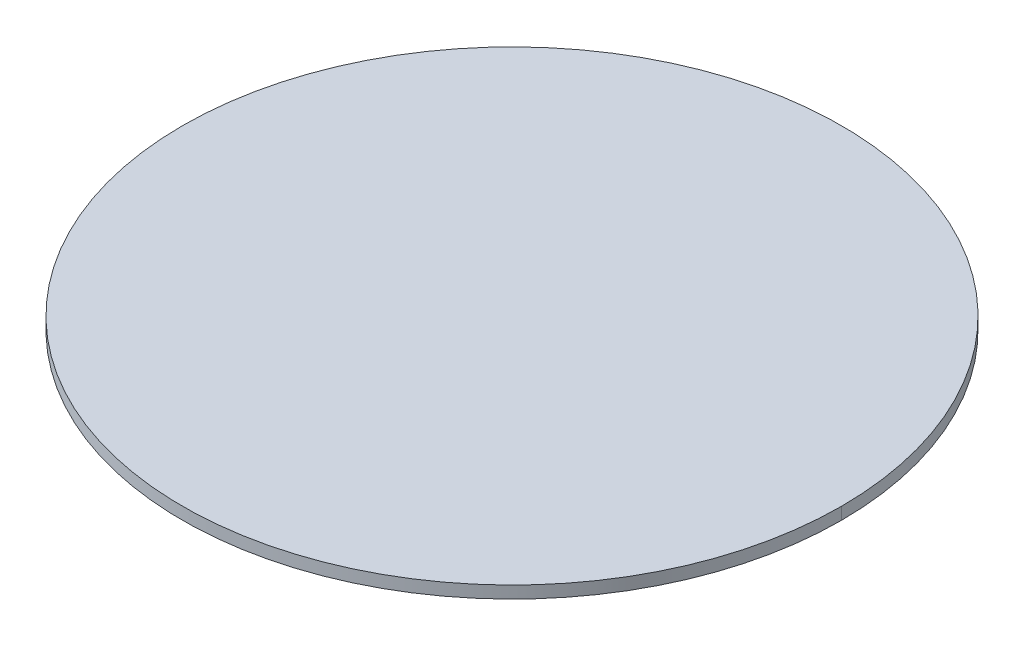
ISO-10303-21;
HEADER;
FILE_DESCRIPTION(('STEP AP214'),'2;1');
FILE_NAME('part.step','',(''),(''),'','','');
FILE_SCHEMA(('AUTOMOTIVE_DESIGN { 1 0 10303 214 1 1 1 1 }'));
ENDSEC;
DATA;
#1=APPLICATION_CONTEXT('core data for automotive mechanical design processes');
#2=APPLICATION_PROTOCOL_DEFINITION('international standard','automotive_design',2000,#1);
#3=PRODUCT_CONTEXT('',#1,'mechanical');
#4=PRODUCT('Part','Part','',(#3));
#5=PRODUCT_RELATED_PRODUCT_CATEGORY('part','',(#4));
#6=PRODUCT_DEFINITION_FORMATION('','',#4);
#7=PRODUCT_DEFINITION_CONTEXT('part definition',#1,'design');
#8=PRODUCT_DEFINITION('design','',#6,#7);
#9=PRODUCT_DEFINITION_SHAPE('','',#8);
#10=(LENGTH_UNIT() NAMED_UNIT(*) SI_UNIT(.MILLI.,.METRE.));
#11=(NAMED_UNIT(*) PLANE_ANGLE_UNIT() SI_UNIT($,.RADIAN.));
#12=(NAMED_UNIT(*) SI_UNIT($,.STERADIAN.) SOLID_ANGLE_UNIT());
#13=UNCERTAINTY_MEASURE_WITH_UNIT(LENGTH_MEASURE(1.E-05),#10,'distance_accuracy_value','');
#14=(GEOMETRIC_REPRESENTATION_CONTEXT(3) GLOBAL_UNCERTAINTY_ASSIGNED_CONTEXT((#13)) GLOBAL_UNIT_ASSIGNED_CONTEXT((#10,
#11,#12)) REPRESENTATION_CONTEXT('',''));
#15=CARTESIAN_POINT('',(0.,0.,0.));
#16=DIRECTION('',(0.,0.,1.));
#17=DIRECTION('',(1.,0.,0.));
#18=AXIS2_PLACEMENT_3D('',#15,#16,#17);
#19=CARTESIAN_POINT('',(0.,0.,0.));
#20=DIRECTION('',(0.,1.,0.));
#21=DIRECTION('',(0.,0.,1.));
#22=AXIS2_PLACEMENT_3D('',#19,#20,#21);
#23=PLANE('',#22);
#24=CARTESIAN_POINT('',(0.,0.,0.));
#25=DIRECTION('',(0.,1.,0.));
#26=DIRECTION('',(1.,0.,0.));
#27=AXIS2_PLACEMENT_3D('',#24,#25,#26);
#28=CIRCLE('',#27,8.2423);
#29=CARTESIAN_POINT('',(8.2423,0.,0.));
#30=VERTEX_POINT('',#29);
#31=CARTESIAN_POINT('',(-8.2423,0.,0.));
#32=VERTEX_POINT('',#31);
#33=EDGE_CURVE('E11',#30,#32,#28,.T.);
#34=ORIENTED_EDGE('',*,*,#33,.F.);
#35=CARTESIAN_POINT('',(0.,0.,0.));
#36=DIRECTION('',(0.,1.,0.));
#37=DIRECTION('',(1.,0.,0.));
#38=AXIS2_PLACEMENT_3D('',#35,#36,#37);
#39=CIRCLE('',#38,8.2423);
#40=EDGE_CURVE('E25',#32,#30,#39,.T.);
#41=ORIENTED_EDGE('',*,*,#40,.F.);
#42=EDGE_LOOP('',(#34,#41));
#43=FACE_BOUND('',#42,.T.);
#44=ADVANCED_FACE('F17',(#43),#23,.F.);
#45=CARTESIAN_POINT('',(0.,0.3048,0.));
#46=DIRECTION('',(0.,1.,0.));
#47=DIRECTION('',(0.,0.,-1.));
#48=AXIS2_PLACEMENT_3D('',#45,#46,#47);
#49=CYLINDRICAL_SURFACE('',#48,8.2423);
#50=ORIENTED_EDGE('',*,*,#40,.T.);
#51=DIRECTION('',(0.,1.,0.));
#52=VECTOR('',#51,1.);
#53=CARTESIAN_POINT('',(8.2423,0.,0.));
#54=LINE('',#53,#52);
#55=CARTESIAN_POINT('',(8.2423,0.3048,0.));
#56=VERTEX_POINT('',#55);
#57=EDGE_CURVE('E45',#30,#56,#54,.T.);
#58=ORIENTED_EDGE('',*,*,#57,.T.);
#59=CARTESIAN_POINT('',(0.,0.3048,0.));
#60=DIRECTION('',(0.,1.,0.));
#61=DIRECTION('',(1.,0.,0.));
#62=AXIS2_PLACEMENT_3D('',#59,#60,#61);
#63=CIRCLE('',#62,8.2423);
#64=CARTESIAN_POINT('',(-8.2423,0.3048,0.));
#65=VERTEX_POINT('',#64);
#66=EDGE_CURVE('E40',#65,#56,#63,.T.);
#67=ORIENTED_EDGE('',*,*,#66,.F.);
#68=DIRECTION('',(0.,1.,0.));
#69=VECTOR('',#68,1.);
#70=CARTESIAN_POINT('',(-8.2423,0.,0.));
#71=LINE('',#70,#69);
#72=EDGE_CURVE('E43',#32,#65,#71,.T.);
#73=ORIENTED_EDGE('',*,*,#72,.F.);
#74=EDGE_LOOP('',(#50,#58,#67,#73));
#75=FACE_BOUND('',#74,.T.);
#76=ADVANCED_FACE('F42',(#75),#49,.T.);
#77=CARTESIAN_POINT('',(0.,0.3048,0.));
#78=DIRECTION('',(0.,1.,0.));
#79=DIRECTION('',(0.,0.,1.));
#80=AXIS2_PLACEMENT_3D('',#77,#78,#79);
#81=CYLINDRICAL_SURFACE('',#80,8.2423);
#82=CARTESIAN_POINT('',(0.,0.3048,0.));
#83=DIRECTION('',(0.,1.,0.));
#84=DIRECTION('',(1.,0.,0.));
#85=AXIS2_PLACEMENT_3D('',#82,#83,#84);
#86=CIRCLE('',#85,8.2423);
#87=EDGE_CURVE('E52',#56,#65,#86,.T.);
#88=ORIENTED_EDGE('',*,*,#87,.F.);
#89=ORIENTED_EDGE('',*,*,#57,.F.);
#90=ORIENTED_EDGE('',*,*,#33,.T.);
#91=ORIENTED_EDGE('',*,*,#72,.T.);
#92=EDGE_LOOP('',(#88,#89,#90,#91));
#93=FACE_BOUND('',#92,.T.);
#94=ADVANCED_FACE('F51',(#93),#81,.T.);
#95=CARTESIAN_POINT('',(0.,0.3048,0.));
#96=DIRECTION('',(0.,1.,0.));
#97=DIRECTION('',(0.,0.,1.));
#98=AXIS2_PLACEMENT_3D('',#95,#96,#97);
#99=PLANE('',#98);
#100=ORIENTED_EDGE('',*,*,#87,.T.);
#101=ORIENTED_EDGE('',*,*,#66,.T.);
#102=EDGE_LOOP('',(#100,#101));
#103=FACE_BOUND('',#102,.T.);
#104=ADVANCED_FACE('F54',(#103),#99,.T.);
#105=CLOSED_SHELL('',(#44,#76,#94,#104));
#106=MANIFOLD_SOLID_BREP('B1',#105);
#107=ADVANCED_BREP_SHAPE_REPRESENTATION('',(#18,#106),#14);
#108=SHAPE_DEFINITION_REPRESENTATION(#9,#107);
ENDSEC;
END-ISO-10303-21;
